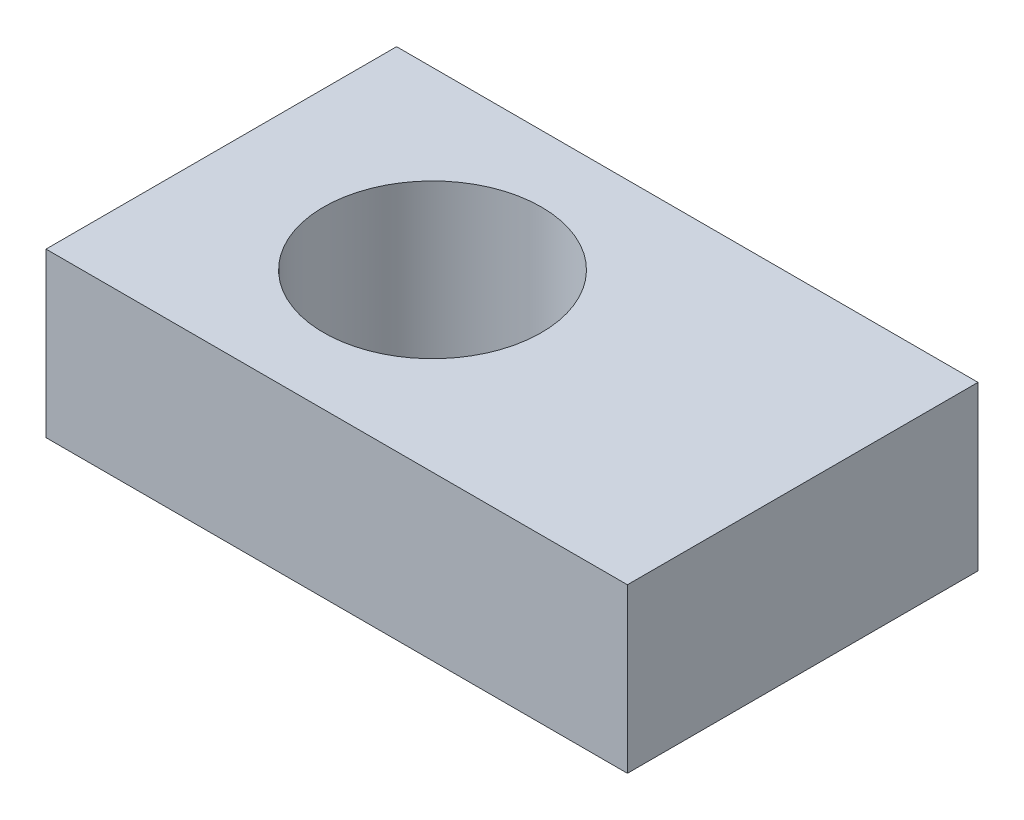
ISO-10303-21;
HEADER;
FILE_DESCRIPTION(('STEP AP214'),'2;1');
FILE_NAME('part.step','',(''),(''),'','','');
FILE_SCHEMA(('AUTOMOTIVE_DESIGN { 1 0 10303 214 1 1 1 1 }'));
ENDSEC;
DATA;
#1=APPLICATION_CONTEXT('core data for automotive mechanical design processes');
#2=APPLICATION_PROTOCOL_DEFINITION('international standard','automotive_design',2000,#1);
#3=PRODUCT_CONTEXT('',#1,'mechanical');
#4=PRODUCT('Part','Part','',(#3));
#5=PRODUCT_RELATED_PRODUCT_CATEGORY('part','',(#4));
#6=PRODUCT_DEFINITION_FORMATION('','',#4);
#7=PRODUCT_DEFINITION_CONTEXT('part definition',#1,'design');
#8=PRODUCT_DEFINITION('design','',#6,#7);
#9=PRODUCT_DEFINITION_SHAPE('','',#8);
#10=(LENGTH_UNIT() NAMED_UNIT(*) SI_UNIT(.MILLI.,.METRE.));
#11=(NAMED_UNIT(*) PLANE_ANGLE_UNIT() SI_UNIT($,.RADIAN.));
#12=(NAMED_UNIT(*) SI_UNIT($,.STERADIAN.) SOLID_ANGLE_UNIT());
#13=UNCERTAINTY_MEASURE_WITH_UNIT(LENGTH_MEASURE(1.E-05),#10,'distance_accuracy_value','');
#14=(GEOMETRIC_REPRESENTATION_CONTEXT(3) GLOBAL_UNCERTAINTY_ASSIGNED_CONTEXT((#13)) GLOBAL_UNIT_ASSIGNED_CONTEXT((#10,
#11,#12)) REPRESENTATION_CONTEXT('',''));
#15=CARTESIAN_POINT('',(0.,0.,0.));
#16=DIRECTION('',(0.,0.,1.));
#17=DIRECTION('',(1.,0.,0.));
#18=AXIS2_PLACEMENT_3D('',#15,#16,#17);
#19=CARTESIAN_POINT('',(34.43,0.02,4.96));
#20=DIRECTION('',(0.,-1.,0.));
#21=DIRECTION('',(0.,0.,-1.));
#22=AXIS2_PLACEMENT_3D('',#19,#20,#21);
#23=PLANE('',#22);
#24=CARTESIAN_POINT('',(33.7,0.0200000000000001,4.96));
#25=DIRECTION('',(0.,-1.,0.));
#26=DIRECTION('',(0.,0.,-1.));
#27=AXIS2_PLACEMENT_3D('',#24,#25,#26);
#28=CIRCLE('',#27,1.);
#29=CARTESIAN_POINT('',(33.7,0.0200000000000001,3.96));
#30=VERTEX_POINT('',#29);
#31=EDGE_CURVE('E20',#30,#30,#28,.F.);
#32=ORIENTED_EDGE('',*,*,#31,.T.);
#33=EDGE_LOOP('',(#32));
#34=FACE_BOUND('',#33,.T.);
#35=DIRECTION('',(0.,0.,1.));
#36=VECTOR('',#35,1.);
#37=CARTESIAN_POINT('',(31.76,0.0200000000000001,6.57));
#38=LINE('',#37,#36);
#39=CARTESIAN_POINT('',(31.76,0.02,3.35));
#40=VERTEX_POINT('',#39);
#41=CARTESIAN_POINT('',(31.76,0.02,6.57));
#42=VERTEX_POINT('',#41);
#43=EDGE_CURVE('E69',#40,#42,#38,.T.);
#44=ORIENTED_EDGE('',*,*,#43,.F.);
#45=DIRECTION('',(-1.,0.,0.));
#46=VECTOR('',#45,1.);
#47=CARTESIAN_POINT('',(31.76,0.0200000000000001,3.35));
#48=LINE('',#47,#46);
#49=CARTESIAN_POINT('',(37.1,0.02,3.35));
#50=VERTEX_POINT('',#49);
#51=EDGE_CURVE('E54',#50,#40,#48,.T.);
#52=ORIENTED_EDGE('',*,*,#51,.F.);
#53=DIRECTION('',(0.,0.,-1.));
#54=VECTOR('',#53,1.);
#55=CARTESIAN_POINT('',(37.1,0.0200000000000001,3.35));
#56=LINE('',#55,#54);
#57=CARTESIAN_POINT('',(37.1,0.02,6.57));
#58=VERTEX_POINT('',#57);
#59=EDGE_CURVE('E59',#58,#50,#56,.T.);
#60=ORIENTED_EDGE('',*,*,#59,.F.);
#61=DIRECTION('',(1.,0.,0.));
#62=VECTOR('',#61,1.);
#63=CARTESIAN_POINT('',(37.1,0.0200000000000001,6.57));
#64=LINE('',#63,#62);
#65=EDGE_CURVE('E82',#42,#58,#64,.T.);
#66=ORIENTED_EDGE('',*,*,#65,.F.);
#67=EDGE_LOOP('',(#44,#52,#60,#66));
#68=FACE_BOUND('',#67,.T.);
#69=ADVANCED_FACE('F17',(#34,#68),#23,.T.);
#70=CARTESIAN_POINT('',(37.1,1.52,3.35));
#71=DIRECTION('',(1.,0.,0.));
#72=DIRECTION('',(0.,0.,-1.));
#73=AXIS2_PLACEMENT_3D('',#70,#71,#72);
#74=PLANE('',#73);
#75=ORIENTED_EDGE('',*,*,#59,.T.);
#76=DIRECTION('',(0.,1.,0.));
#77=VECTOR('',#76,1.);
#78=CARTESIAN_POINT('',(37.1,1.52,3.35));
#79=LINE('',#78,#77);
#80=CARTESIAN_POINT('',(37.1,1.52,3.35));
#81=VERTEX_POINT('',#80);
#82=EDGE_CURVE('E61',#81,#50,#79,.F.);
#83=ORIENTED_EDGE('',*,*,#82,.F.);
#84=DIRECTION('',(0.,0.,1.));
#85=VECTOR('',#84,1.);
#86=CARTESIAN_POINT('',(37.1,1.52,4.96));
#87=LINE('',#86,#85);
#88=CARTESIAN_POINT('',(37.1,1.52,6.57));
#89=VERTEX_POINT('',#88);
#90=EDGE_CURVE('E85',#89,#81,#87,.F.);
#91=ORIENTED_EDGE('',*,*,#90,.F.);
#92=DIRECTION('',(0.,1.,0.));
#93=VECTOR('',#92,1.);
#94=CARTESIAN_POINT('',(37.1,1.52,6.57));
#95=LINE('',#94,#93);
#96=EDGE_CURVE('E64',#58,#89,#95,.T.);
#97=ORIENTED_EDGE('',*,*,#96,.F.);
#98=EDGE_LOOP('',(#75,#83,#91,#97));
#99=FACE_BOUND('',#98,.T.);
#100=ADVANCED_FACE('F60',(#99),#74,.T.);
#101=CARTESIAN_POINT('',(31.76,1.52,3.35));
#102=DIRECTION('',(0.,0.,-1.));
#103=DIRECTION('',(-1.,0.,0.));
#104=AXIS2_PLACEMENT_3D('',#101,#102,#103);
#105=PLANE('',#104);
#106=ORIENTED_EDGE('',*,*,#51,.T.);
#107=DIRECTION('',(0.,1.,0.));
#108=VECTOR('',#107,1.);
#109=CARTESIAN_POINT('',(31.76,1.52,3.35));
#110=LINE('',#109,#108);
#111=CARTESIAN_POINT('',(31.76,1.52,3.35));
#112=VERTEX_POINT('',#111);
#113=EDGE_CURVE('E71',#112,#40,#110,.F.);
#114=ORIENTED_EDGE('',*,*,#113,.F.);
#115=DIRECTION('',(1.,0.,0.));
#116=VECTOR('',#115,1.);
#117=CARTESIAN_POINT('',(34.43,1.52,3.35));
#118=LINE('',#117,#116);
#119=EDGE_CURVE('E75',#81,#112,#118,.F.);
#120=ORIENTED_EDGE('',*,*,#119,.F.);
#121=ORIENTED_EDGE('',*,*,#82,.T.);
#122=EDGE_LOOP('',(#106,#114,#120,#121));
#123=FACE_BOUND('',#122,.T.);
#124=ADVANCED_FACE('F73',(#123),#105,.T.);
#125=CARTESIAN_POINT('',(31.76,1.52,6.57));
#126=DIRECTION('',(-1.,0.,0.));
#127=DIRECTION('',(0.,0.,1.));
#128=AXIS2_PLACEMENT_3D('',#125,#126,#127);
#129=PLANE('',#128);
#130=ORIENTED_EDGE('',*,*,#43,.T.);
#131=DIRECTION('',(0.,1.,0.));
#132=VECTOR('',#131,1.);
#133=CARTESIAN_POINT('',(31.76,1.52,6.57));
#134=LINE('',#133,#132);
#135=CARTESIAN_POINT('',(31.76,1.52,6.57));
#136=VERTEX_POINT('',#135);
#137=EDGE_CURVE('E34',#136,#42,#134,.F.);
#138=ORIENTED_EDGE('',*,*,#137,.F.);
#139=DIRECTION('',(0.,0.,1.));
#140=VECTOR('',#139,1.);
#141=CARTESIAN_POINT('',(31.76,1.52,4.96));
#142=LINE('',#141,#140);
#143=EDGE_CURVE('E88',#112,#136,#142,.T.);
#144=ORIENTED_EDGE('',*,*,#143,.F.);
#145=ORIENTED_EDGE('',*,*,#113,.T.);
#146=EDGE_LOOP('',(#130,#138,#144,#145));
#147=FACE_BOUND('',#146,.T.);
#148=ADVANCED_FACE('F98',(#147),#129,.T.);
#149=CARTESIAN_POINT('',(37.1,1.52,6.57));
#150=DIRECTION('',(0.,0.,1.));
#151=DIRECTION('',(1.,0.,0.));
#152=AXIS2_PLACEMENT_3D('',#149,#150,#151);
#153=PLANE('',#152);
#154=ORIENTED_EDGE('',*,*,#65,.T.);
#155=ORIENTED_EDGE('',*,*,#96,.T.);
#156=DIRECTION('',(1.,0.,0.));
#157=VECTOR('',#156,1.);
#158=CARTESIAN_POINT('',(34.43,1.52,6.57));
#159=LINE('',#158,#157);
#160=EDGE_CURVE('E26',#136,#89,#159,.T.);
#161=ORIENTED_EDGE('',*,*,#160,.F.);
#162=ORIENTED_EDGE('',*,*,#137,.T.);
#163=EDGE_LOOP('',(#154,#155,#161,#162));
#164=FACE_BOUND('',#163,.T.);
#165=ADVANCED_FACE('F95',(#164),#153,.T.);
#166=CARTESIAN_POINT('',(33.7,1.52,4.96));
#167=DIRECTION('',(0.,-1.,0.));
#168=DIRECTION('',(0.,0.,-1.));
#169=AXIS2_PLACEMENT_3D('',#166,#167,#168);
#170=CYLINDRICAL_SURFACE('',#169,1.);
#171=ORIENTED_EDGE('',*,*,#31,.F.);
#172=EDGE_LOOP('',(#171));
#173=FACE_BOUND('',#172,.T.);
#174=CARTESIAN_POINT('',(33.7,1.52,4.96));
#175=DIRECTION('',(0.,-1.,0.));
#176=DIRECTION('',(0.,0.,-1.));
#177=AXIS2_PLACEMENT_3D('',#174,#175,#176);
#178=CIRCLE('',#177,1.);
#179=CARTESIAN_POINT('',(33.7,1.52,3.96));
#180=VERTEX_POINT('',#179);
#181=EDGE_CURVE('E11',#180,#180,#178,.T.);
#182=ORIENTED_EDGE('',*,*,#181,.F.);
#183=EDGE_LOOP('',(#182));
#184=FACE_BOUND('',#183,.T.);
#185=ADVANCED_FACE('F97',(#173,#184),#170,.F.);
#186=CARTESIAN_POINT('',(34.43,1.52,4.96));
#187=DIRECTION('',(0.,1.,0.));
#188=DIRECTION('',(0.,0.,1.));
#189=AXIS2_PLACEMENT_3D('',#186,#187,#188);
#190=PLANE('',#189);
#191=ORIENTED_EDGE('',*,*,#181,.T.);
#192=EDGE_LOOP('',(#191));
#193=FACE_BOUND('',#192,.T.);
#194=ORIENTED_EDGE('',*,*,#143,.T.);
#195=ORIENTED_EDGE('',*,*,#160,.T.);
#196=ORIENTED_EDGE('',*,*,#90,.T.);
#197=ORIENTED_EDGE('',*,*,#119,.T.);
#198=EDGE_LOOP('',(#194,#195,#196,#197));
#199=FACE_BOUND('',#198,.T.);
#200=ADVANCED_FACE('F93',(#193,#199),#190,.T.);
#201=CLOSED_SHELL('',(#69,#100,#124,#148,#165,#185,#200));
#202=MANIFOLD_SOLID_BREP('B1',#201);
#203=ADVANCED_BREP_SHAPE_REPRESENTATION('',(#18,#202),#14);
#204=SHAPE_DEFINITION_REPRESENTATION(#9,#203);
ENDSEC;
END-ISO-10303-21;
